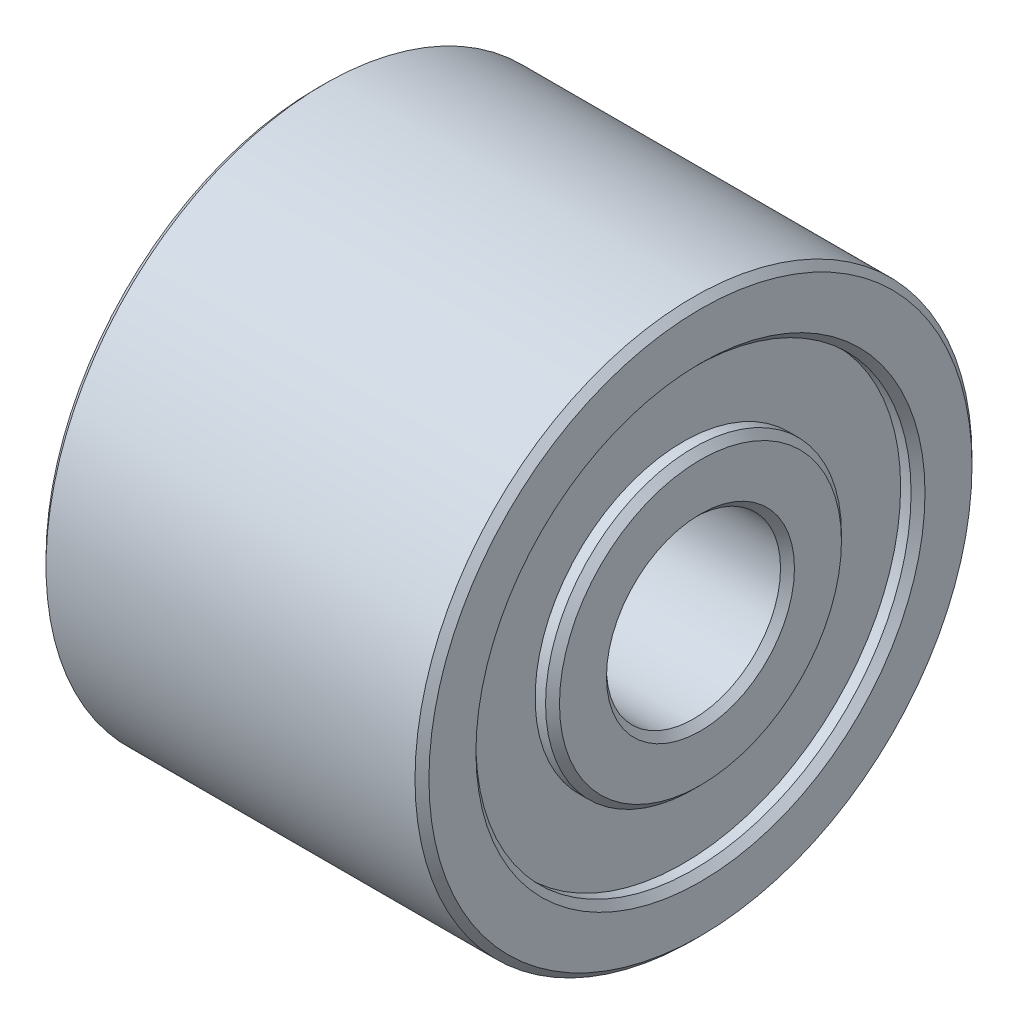
ISO-10303-21;
HEADER;
FILE_DESCRIPTION(('STEP AP214'),'2;1');
FILE_NAME('part.step','',(''),(''),'','','');
FILE_SCHEMA(('AUTOMOTIVE_DESIGN { 1 0 10303 214 1 1 1 1 }'));
ENDSEC;
DATA;
#1=APPLICATION_CONTEXT('core data for automotive mechanical design processes');
#2=APPLICATION_PROTOCOL_DEFINITION('international standard','automotive_design',2000,#1);
#3=PRODUCT_CONTEXT('',#1,'mechanical');
#4=PRODUCT('Part','Part','',(#3));
#5=PRODUCT_RELATED_PRODUCT_CATEGORY('part','',(#4));
#6=PRODUCT_DEFINITION_FORMATION('','',#4);
#7=PRODUCT_DEFINITION_CONTEXT('part definition',#1,'design');
#8=PRODUCT_DEFINITION('design','',#6,#7);
#9=PRODUCT_DEFINITION_SHAPE('','',#8);
#10=(LENGTH_UNIT() NAMED_UNIT(*) SI_UNIT(.MILLI.,.METRE.));
#11=(NAMED_UNIT(*) PLANE_ANGLE_UNIT() SI_UNIT($,.RADIAN.));
#12=(NAMED_UNIT(*) SI_UNIT($,.STERADIAN.) SOLID_ANGLE_UNIT());
#13=UNCERTAINTY_MEASURE_WITH_UNIT(LENGTH_MEASURE(1.E-05),#10,'distance_accuracy_value','');
#14=(GEOMETRIC_REPRESENTATION_CONTEXT(3) GLOBAL_UNCERTAINTY_ASSIGNED_CONTEXT((#13)) GLOBAL_UNIT_ASSIGNED_CONTEXT((#10,
#11,#12)) REPRESENTATION_CONTEXT('',''));
#15=CARTESIAN_POINT('',(0.,0.,0.));
#16=DIRECTION('',(0.,0.,1.));
#17=DIRECTION('',(1.,0.,0.));
#18=AXIS2_PLACEMENT_3D('',#15,#16,#17);
#19=CARTESIAN_POINT('',(0.,0.,0.));
#20=DIRECTION('',(1.,0.,0.));
#21=DIRECTION('',(0.,0.,-1.));
#22=AXIS2_PLACEMENT_3D('',#19,#20,#21);
#23=CYLINDRICAL_SURFACE('',#22,2.5);
#24=CARTESIAN_POINT('',(5.30000000003383,0.,0.));
#25=DIRECTION('',(1.,0.,0.));
#26=DIRECTION('',(0.,0.,-1.));
#27=AXIS2_PLACEMENT_3D('',#24,#25,#26);
#28=CIRCLE('',#27,2.49999999999773);
#29=CARTESIAN_POINT('',(5.30000000003383,0.,-2.49999999999773));
#30=VERTEX_POINT('',#29);
#31=EDGE_CURVE('E53',#30,#30,#28,.T.);
#32=ORIENTED_EDGE('',*,*,#31,.T.);
#33=EDGE_LOOP('',(#32));
#34=FACE_BOUND('',#33,.T.);
#35=CARTESIAN_POINT('',(-5.29999999997699,0.,0.));
#36=DIRECTION('',(-1.,0.,0.));
#37=DIRECTION('',(0.,0.,1.));
#38=AXIS2_PLACEMENT_3D('',#35,#36,#37);
#39=CIRCLE('',#38,2.49999999994088);
#40=CARTESIAN_POINT('',(-5.29999999997699,0.,2.49999999994088));
#41=VERTEX_POINT('',#40);
#42=EDGE_CURVE('E50',#41,#41,#39,.T.);
#43=ORIENTED_EDGE('',*,*,#42,.T.);
#44=EDGE_LOOP('',(#43));
#45=FACE_BOUND('',#44,.T.);
#46=ADVANCED_FACE('F15',(#34,#45),#23,.F.);
#47=CARTESIAN_POINT('',(5.49999999998363,0.,0.));
#48=DIRECTION('',(1.,0.,0.));
#49=DIRECTION('',(0.,0.,-1.));
#50=AXIS2_PLACEMENT_3D('',#47,#48,#49);
#51=CONICAL_SURFACE('',#50,2.69999999994752,0.785398163397448);
#52=CARTESIAN_POINT('',(5.49999999998363,0.,0.));
#53=DIRECTION('',(1.,0.,0.));
#54=DIRECTION('',(0.,0.,-1.));
#55=AXIS2_PLACEMENT_3D('',#52,#53,#54);
#56=CIRCLE('',#55,2.69999999994752);
#57=CARTESIAN_POINT('',(5.49999999998363,0.,-2.69999999994752));
#58=VERTEX_POINT('',#57);
#59=EDGE_CURVE('E18',#58,#58,#56,.F.);
#60=ORIENTED_EDGE('',*,*,#59,.F.);
#61=EDGE_LOOP('',(#60));
#62=FACE_BOUND('',#61,.T.);
#63=ORIENTED_EDGE('',*,*,#31,.F.);
#64=EDGE_LOOP('',(#63));
#65=FACE_BOUND('',#64,.T.);
#66=ADVANCED_FACE('F90',(#62,#65),#51,.F.);
#67=CARTESIAN_POINT('',(-5.49999999998363,0.,0.));
#68=DIRECTION('',(-1.,0.,0.));
#69=DIRECTION('',(0.,0.,1.));
#70=AXIS2_PLACEMENT_3D('',#67,#68,#69);
#71=CONICAL_SURFACE('',#70,2.70000000000437,0.785398163539557);
#72=CARTESIAN_POINT('',(-5.49999999998363,0.,0.));
#73=DIRECTION('',(-1.,0.,0.));
#74=DIRECTION('',(0.,0.,1.));
#75=AXIS2_PLACEMENT_3D('',#72,#73,#74);
#76=CIRCLE('',#75,2.70000000000437);
#77=CARTESIAN_POINT('',(-5.49999999998363,0.,2.70000000000437));
#78=VERTEX_POINT('',#77);
#79=EDGE_CURVE('E80',#78,#78,#76,.F.);
#80=ORIENTED_EDGE('',*,*,#79,.F.);
#81=EDGE_LOOP('',(#80));
#82=FACE_BOUND('',#81,.T.);
#83=ORIENTED_EDGE('',*,*,#42,.F.);
#84=EDGE_LOOP('',(#83));
#85=FACE_BOUND('',#84,.T.);
#86=ADVANCED_FACE('F93',(#82,#85),#71,.F.);
#87=CARTESIAN_POINT('',(5.5,2.5,0.));
#88=DIRECTION('',(1.,0.,0.));
#89=DIRECTION('',(0.,0.,-1.));
#90=AXIS2_PLACEMENT_3D('',#87,#88,#89);
#91=PLANE('',#90);
#92=ORIENTED_EDGE('',*,*,#59,.T.);
#93=EDGE_LOOP('',(#92));
#94=FACE_BOUND('',#93,.T.);
#95=CARTESIAN_POINT('',(5.49999999998363,0.,0.));
#96=DIRECTION('',(-1.,0.,0.));
#97=DIRECTION('',(0.,0.,1.));
#98=AXIS2_PLACEMENT_3D('',#95,#96,#97);
#99=CIRCLE('',#98,4.05000000000655);
#100=CARTESIAN_POINT('',(5.49999999998363,0.,4.05000000000655));
#101=VERTEX_POINT('',#100);
#102=EDGE_CURVE('E78',#101,#101,#99,.T.);
#103=ORIENTED_EDGE('',*,*,#102,.F.);
#104=EDGE_LOOP('',(#103));
#105=FACE_BOUND('',#104,.T.);
#106=ADVANCED_FACE('F87',(#94,#105),#91,.T.);
#107=CARTESIAN_POINT('',(-5.5,2.5,0.));
#108=DIRECTION('',(-1.,0.,0.));
#109=DIRECTION('',(0.,0.,1.));
#110=AXIS2_PLACEMENT_3D('',#107,#108,#109);
#111=PLANE('',#110);
#112=ORIENTED_EDGE('',*,*,#79,.T.);
#113=EDGE_LOOP('',(#112));
#114=FACE_BOUND('',#113,.T.);
#115=CARTESIAN_POINT('',(-5.50000000004047,0.,0.));
#116=DIRECTION('',(1.,0.,0.));
#117=DIRECTION('',(0.,0.,-1.));
#118=AXIS2_PLACEMENT_3D('',#115,#116,#117);
#119=CIRCLE('',#118,4.05000000000655);
#120=CARTESIAN_POINT('',(-5.50000000004047,0.,-4.05000000000655));
#121=VERTEX_POINT('',#120);
#122=EDGE_CURVE('E47',#121,#121,#119,.T.);
#123=ORIENTED_EDGE('',*,*,#122,.F.);
#124=EDGE_LOOP('',(#123));
#125=FACE_BOUND('',#124,.T.);
#126=ADVANCED_FACE('F107',(#114,#125),#111,.T.);
#127=CARTESIAN_POINT('',(5.29999999997699,0.,0.));
#128=DIRECTION('',(-1.,0.,0.));
#129=DIRECTION('',(0.,0.,1.));
#130=AXIS2_PLACEMENT_3D('',#127,#128,#129);
#131=CONICAL_SURFACE('',#130,4.25000000001319,0.785398163397448);
#132=ORIENTED_EDGE('',*,*,#102,.T.);
#133=EDGE_LOOP('',(#132));
#134=FACE_BOUND('',#133,.T.);
#135=CARTESIAN_POINT('',(5.3,0.,0.));
#136=DIRECTION('',(1.,0.,0.));
#137=DIRECTION('',(0.,0.,-1.));
#138=AXIS2_PLACEMENT_3D('',#135,#136,#137);
#139=CIRCLE('',#138,4.25);
#140=CARTESIAN_POINT('',(5.3,0.,-4.25));
#141=VERTEX_POINT('',#140);
#142=EDGE_CURVE('E44',#141,#141,#139,.F.);
#143=ORIENTED_EDGE('',*,*,#142,.F.);
#144=EDGE_LOOP('',(#143));
#145=FACE_BOUND('',#144,.T.);
#146=ADVANCED_FACE('F167',(#134,#145),#131,.T.);
#147=CARTESIAN_POINT('',(-5.29999999997699,0.,0.));
#148=DIRECTION('',(1.,0.,0.));
#149=DIRECTION('',(0.,0.,-1.));
#150=AXIS2_PLACEMENT_3D('',#147,#148,#149);
#151=CONICAL_SURFACE('',#150,4.25000000007003,0.785398163397448);
#152=ORIENTED_EDGE('',*,*,#122,.T.);
#153=EDGE_LOOP('',(#152));
#154=FACE_BOUND('',#153,.T.);
#155=CARTESIAN_POINT('',(-5.3,0.,0.));
#156=DIRECTION('',(1.,0.,0.));
#157=DIRECTION('',(0.,0.,-1.));
#158=AXIS2_PLACEMENT_3D('',#155,#156,#157);
#159=CIRCLE('',#158,4.25);
#160=CARTESIAN_POINT('',(-5.3,0.,-4.25));
#161=VERTEX_POINT('',#160);
#162=EDGE_CURVE('E40',#161,#161,#159,.T.);
#163=ORIENTED_EDGE('',*,*,#162,.F.);
#164=EDGE_LOOP('',(#163));
#165=FACE_BOUND('',#164,.T.);
#166=ADVANCED_FACE('F163',(#154,#165),#151,.T.);
#167=CARTESIAN_POINT('',(0.,0.,0.));
#168=DIRECTION('',(1.,0.,0.));
#169=DIRECTION('',(0.,0.,-1.));
#170=AXIS2_PLACEMENT_3D('',#167,#168,#169);
#171=CYLINDRICAL_SURFACE('',#170,4.25);
#172=CARTESIAN_POINT('',(5.,0.,0.));
#173=DIRECTION('',(1.,0.,0.));
#174=DIRECTION('',(0.,0.,-1.));
#175=AXIS2_PLACEMENT_3D('',#172,#173,#174);
#176=CIRCLE('',#175,4.25);
#177=CARTESIAN_POINT('',(5.,0.,-4.25));
#178=VERTEX_POINT('',#177);
#179=EDGE_CURVE('E43',#178,#178,#176,.F.);
#180=ORIENTED_EDGE('',*,*,#179,.F.);
#181=EDGE_LOOP('',(#180));
#182=FACE_BOUND('',#181,.T.);
#183=ORIENTED_EDGE('',*,*,#142,.T.);
#184=EDGE_LOOP('',(#183));
#185=FACE_BOUND('',#184,.T.);
#186=ADVANCED_FACE('F159',(#182,#185),#171,.T.);
#187=CARTESIAN_POINT('',(0.,0.,0.));
#188=DIRECTION('',(1.,0.,0.));
#189=DIRECTION('',(0.,0.,-1.));
#190=AXIS2_PLACEMENT_3D('',#187,#188,#189);
#191=CYLINDRICAL_SURFACE('',#190,4.25);
#192=ORIENTED_EDGE('',*,*,#162,.T.);
#193=EDGE_LOOP('',(#192));
#194=FACE_BOUND('',#193,.T.);
#195=CARTESIAN_POINT('',(-5.,0.,0.));
#196=DIRECTION('',(1.,0.,0.));
#197=DIRECTION('',(0.,0.,-1.));
#198=AXIS2_PLACEMENT_3D('',#195,#196,#197);
#199=CIRCLE('',#198,4.25);
#200=CARTESIAN_POINT('',(-5.,0.,-4.25));
#201=VERTEX_POINT('',#200);
#202=EDGE_CURVE('E71',#201,#201,#199,.T.);
#203=ORIENTED_EDGE('',*,*,#202,.F.);
#204=EDGE_LOOP('',(#203));
#205=FACE_BOUND('',#204,.T.);
#206=ADVANCED_FACE('F155',(#194,#205),#191,.T.);
#207=CARTESIAN_POINT('',(5.,4.25,0.));
#208=DIRECTION('',(1.,0.,0.));
#209=DIRECTION('',(0.,0.,-1.));
#210=AXIS2_PLACEMENT_3D('',#207,#208,#209);
#211=PLANE('',#210);
#212=ORIENTED_EDGE('',*,*,#179,.T.);
#213=EDGE_LOOP('',(#212));
#214=FACE_BOUND('',#213,.T.);
#215=CARTESIAN_POINT('',(5.,0.,0.));
#216=DIRECTION('',(1.,0.,0.));
#217=DIRECTION('',(0.,0.,-1.));
#218=AXIS2_PLACEMENT_3D('',#215,#216,#217);
#219=CIRCLE('',#218,6.25);
#220=CARTESIAN_POINT('',(5.,0.,-6.25));
#221=VERTEX_POINT('',#220);
#222=EDGE_CURVE('E68',#221,#221,#219,.T.);
#223=ORIENTED_EDGE('',*,*,#222,.T.);
#224=EDGE_LOOP('',(#223));
#225=FACE_BOUND('',#224,.T.);
#226=ADVANCED_FACE('F151',(#214,#225),#211,.T.);
#227=CARTESIAN_POINT('',(-5.,4.25,0.));
#228=DIRECTION('',(-1.,0.,0.));
#229=DIRECTION('',(0.,0.,1.));
#230=AXIS2_PLACEMENT_3D('',#227,#228,#229);
#231=PLANE('',#230);
#232=ORIENTED_EDGE('',*,*,#202,.T.);
#233=EDGE_LOOP('',(#232));
#234=FACE_BOUND('',#233,.T.);
#235=CARTESIAN_POINT('',(-5.,0.,0.));
#236=DIRECTION('',(1.,0.,0.));
#237=DIRECTION('',(0.,0.,-1.));
#238=AXIS2_PLACEMENT_3D('',#235,#236,#237);
#239=CIRCLE('',#238,6.25);
#240=CARTESIAN_POINT('',(-5.,0.,-6.25));
#241=VERTEX_POINT('',#240);
#242=EDGE_CURVE('E39',#241,#241,#239,.F.);
#243=ORIENTED_EDGE('',*,*,#242,.T.);
#244=EDGE_LOOP('',(#243));
#245=FACE_BOUND('',#244,.T.);
#246=ADVANCED_FACE('F147',(#234,#245),#231,.T.);
#247=CARTESIAN_POINT('',(0.,0.,0.));
#248=DIRECTION('',(1.,0.,0.));
#249=DIRECTION('',(0.,0.,-1.));
#250=AXIS2_PLACEMENT_3D('',#247,#248,#249);
#251=CYLINDRICAL_SURFACE('',#250,6.25);
#252=CARTESIAN_POINT('',(5.29999999992015,0.,0.));
#253=DIRECTION('',(1.,0.,0.));
#254=DIRECTION('',(0.,0.,-1.));
#255=AXIS2_PLACEMENT_3D('',#252,#253,#254);
#256=CIRCLE('',#255,6.25000000002274);
#257=CARTESIAN_POINT('',(5.29999999992015,0.,-6.25000000002274));
#258=VERTEX_POINT('',#257);
#259=EDGE_CURVE('E36',#258,#258,#256,.T.);
#260=ORIENTED_EDGE('',*,*,#259,.T.);
#261=EDGE_LOOP('',(#260));
#262=FACE_BOUND('',#261,.T.);
#263=ORIENTED_EDGE('',*,*,#222,.F.);
#264=EDGE_LOOP('',(#263));
#265=FACE_BOUND('',#264,.T.);
#266=ADVANCED_FACE('F143',(#262,#265),#251,.F.);
#267=CARTESIAN_POINT('',(0.,0.,0.));
#268=DIRECTION('',(1.,0.,0.));
#269=DIRECTION('',(0.,0.,-1.));
#270=AXIS2_PLACEMENT_3D('',#267,#268,#269);
#271=CYLINDRICAL_SURFACE('',#270,6.25);
#272=ORIENTED_EDGE('',*,*,#242,.F.);
#273=EDGE_LOOP('',(#272));
#274=FACE_BOUND('',#273,.T.);
#275=CARTESIAN_POINT('',(-5.30000000003383,0.,0.));
#276=DIRECTION('',(-1.,0.,0.));
#277=DIRECTION('',(0.,0.,1.));
#278=AXIS2_PLACEMENT_3D('',#275,#276,#277);
#279=CIRCLE('',#278,6.25000000002274);
#280=CARTESIAN_POINT('',(-5.30000000003383,0.,6.25000000002274));
#281=VERTEX_POINT('',#280);
#282=EDGE_CURVE('E32',#281,#281,#279,.T.);
#283=ORIENTED_EDGE('',*,*,#282,.T.);
#284=EDGE_LOOP('',(#283));
#285=FACE_BOUND('',#284,.T.);
#286=ADVANCED_FACE('F139',(#274,#285),#271,.F.);
#287=CARTESIAN_POINT('',(5.49999999998363,0.,0.));
#288=DIRECTION('',(1.,0.,0.));
#289=DIRECTION('',(0.,0.,-1.));
#290=AXIS2_PLACEMENT_3D('',#287,#288,#289);
#291=CONICAL_SURFACE('',#290,6.45000000008622,0.785398163397448);
#292=CARTESIAN_POINT('',(5.49999999998363,0.,0.));
#293=DIRECTION('',(1.,0.,0.));
#294=DIRECTION('',(0.,0.,-1.));
#295=AXIS2_PLACEMENT_3D('',#292,#293,#294);
#296=CIRCLE('',#295,6.45000000008622);
#297=CARTESIAN_POINT('',(5.49999999998363,0.,-6.45000000008622));
#298=VERTEX_POINT('',#297);
#299=EDGE_CURVE('E35',#298,#298,#296,.F.);
#300=ORIENTED_EDGE('',*,*,#299,.F.);
#301=EDGE_LOOP('',(#300));
#302=FACE_BOUND('',#301,.T.);
#303=ORIENTED_EDGE('',*,*,#259,.F.);
#304=EDGE_LOOP('',(#303));
#305=FACE_BOUND('',#304,.T.);
#306=ADVANCED_FACE('F135',(#302,#305),#291,.F.);
#307=CARTESIAN_POINT('',(-5.49999999992679,0.,0.));
#308=DIRECTION('',(-1.,0.,0.));
#309=DIRECTION('',(0.,0.,1.));
#310=AXIS2_PLACEMENT_3D('',#307,#308,#309);
#311=CONICAL_SURFACE('',#310,6.44999999985885,0.785398163397448);
#312=CARTESIAN_POINT('',(-5.50000000004047,0.,0.));
#313=DIRECTION('',(-1.,0.,0.));
#314=DIRECTION('',(0.,0.,1.));
#315=AXIS2_PLACEMENT_3D('',#312,#313,#314);
#316=CIRCLE('',#315,6.44999999997253);
#317=CARTESIAN_POINT('',(-5.50000000004047,0.,6.44999999997253));
#318=VERTEX_POINT('',#317);
#319=EDGE_CURVE('E61',#318,#318,#316,.F.);
#320=ORIENTED_EDGE('',*,*,#319,.F.);
#321=EDGE_LOOP('',(#320));
#322=FACE_BOUND('',#321,.T.);
#323=ORIENTED_EDGE('',*,*,#282,.F.);
#324=EDGE_LOOP('',(#323));
#325=FACE_BOUND('',#324,.T.);
#326=ADVANCED_FACE('F131',(#322,#325),#311,.F.);
#327=CARTESIAN_POINT('',(5.5,6.25,0.));
#328=DIRECTION('',(1.,0.,0.));
#329=DIRECTION('',(0.,0.,-1.));
#330=AXIS2_PLACEMENT_3D('',#327,#328,#329);
#331=PLANE('',#330);
#332=ORIENTED_EDGE('',*,*,#299,.T.);
#333=EDGE_LOOP('',(#332));
#334=FACE_BOUND('',#333,.T.);
#335=CARTESIAN_POINT('',(5.5,0.,0.));
#336=DIRECTION('',(-1.,0.,0.));
#337=DIRECTION('',(0.,0.,1.));
#338=AXIS2_PLACEMENT_3D('',#335,#336,#337);
#339=CIRCLE('',#338,7.8);
#340=CARTESIAN_POINT('',(5.5,0.,7.8));
#341=VERTEX_POINT('',#340);
#342=EDGE_CURVE('E58',#341,#341,#339,.T.);
#343=ORIENTED_EDGE('',*,*,#342,.F.);
#344=EDGE_LOOP('',(#343));
#345=FACE_BOUND('',#344,.T.);
#346=ADVANCED_FACE('F127',(#334,#345),#331,.T.);
#347=CARTESIAN_POINT('',(-5.5,6.25,0.));
#348=DIRECTION('',(-1.,0.,0.));
#349=DIRECTION('',(0.,0.,1.));
#350=AXIS2_PLACEMENT_3D('',#347,#348,#349);
#351=PLANE('',#350);
#352=ORIENTED_EDGE('',*,*,#319,.T.);
#353=EDGE_LOOP('',(#352));
#354=FACE_BOUND('',#353,.T.);
#355=CARTESIAN_POINT('',(-5.5,0.,0.));
#356=DIRECTION('',(1.,0.,0.));
#357=DIRECTION('',(0.,0.,-1.));
#358=AXIS2_PLACEMENT_3D('',#355,#356,#357);
#359=CIRCLE('',#358,7.8);
#360=CARTESIAN_POINT('',(-5.5,0.,-7.8));
#361=VERTEX_POINT('',#360);
#362=EDGE_CURVE('E27',#361,#361,#359,.T.);
#363=ORIENTED_EDGE('',*,*,#362,.F.);
#364=EDGE_LOOP('',(#363));
#365=FACE_BOUND('',#364,.T.);
#366=ADVANCED_FACE('F123',(#354,#365),#351,.T.);
#367=CARTESIAN_POINT('',(5.3,0.,0.));
#368=DIRECTION('',(-1.,0.,0.));
#369=DIRECTION('',(0.,0.,1.));
#370=AXIS2_PLACEMENT_3D('',#367,#368,#369);
#371=CONICAL_SURFACE('',#370,8.,0.785398163397457);
#372=ORIENTED_EDGE('',*,*,#342,.T.);
#373=EDGE_LOOP('',(#372));
#374=FACE_BOUND('',#373,.T.);
#375=CARTESIAN_POINT('',(5.3,0.,0.));
#376=DIRECTION('',(1.,0.,0.));
#377=DIRECTION('',(0.,0.,-1.));
#378=AXIS2_PLACEMENT_3D('',#375,#376,#377);
#379=CIRCLE('',#378,8.);
#380=CARTESIAN_POINT('',(5.3,0.,-8.));
#381=VERTEX_POINT('',#380);
#382=EDGE_CURVE('E22',#381,#381,#379,.F.);
#383=ORIENTED_EDGE('',*,*,#382,.F.);
#384=EDGE_LOOP('',(#383));
#385=FACE_BOUND('',#384,.T.);
#386=ADVANCED_FACE('F116',(#374,#385),#371,.T.);
#387=CARTESIAN_POINT('',(-5.3,0.,0.));
#388=DIRECTION('',(1.,0.,0.));
#389=DIRECTION('',(0.,0.,-1.));
#390=AXIS2_PLACEMENT_3D('',#387,#388,#389);
#391=CONICAL_SURFACE('',#390,8.,0.785398163397459);
#392=ORIENTED_EDGE('',*,*,#362,.T.);
#393=EDGE_LOOP('',(#392));
#394=FACE_BOUND('',#393,.T.);
#395=CARTESIAN_POINT('',(-5.3,0.,0.));
#396=DIRECTION('',(1.,0.,0.));
#397=DIRECTION('',(0.,0.,-1.));
#398=AXIS2_PLACEMENT_3D('',#395,#396,#397);
#399=CIRCLE('',#398,8.);
#400=CARTESIAN_POINT('',(-5.3,0.,-8.));
#401=VERTEX_POINT('',#400);
#402=EDGE_CURVE('E10',#401,#401,#399,.T.);
#403=ORIENTED_EDGE('',*,*,#402,.F.);
#404=EDGE_LOOP('',(#403));
#405=FACE_BOUND('',#404,.T.);
#406=ADVANCED_FACE('F111',(#394,#405),#391,.T.);
#407=CARTESIAN_POINT('',(0.,0.,0.));
#408=DIRECTION('',(1.,0.,0.));
#409=DIRECTION('',(0.,0.,-1.));
#410=AXIS2_PLACEMENT_3D('',#407,#408,#409);
#411=CYLINDRICAL_SURFACE('',#410,8.);
#412=ORIENTED_EDGE('',*,*,#402,.T.);
#413=EDGE_LOOP('',(#412));
#414=FACE_BOUND('',#413,.T.);
#415=ORIENTED_EDGE('',*,*,#382,.T.);
#416=EDGE_LOOP('',(#415));
#417=FACE_BOUND('',#416,.T.);
#418=ADVANCED_FACE('F109',(#414,#417),#411,.T.);
#419=CLOSED_SHELL('',(#46,#66,#86,#106,#126,#146,#166,#186,#206,#226,#246,#266,#286,#306,#326,
#346,#366,#386,#406,#418));
#420=MANIFOLD_SOLID_BREP('B1',#419);
#421=ADVANCED_BREP_SHAPE_REPRESENTATION('',(#18,#420),#14);
#422=SHAPE_DEFINITION_REPRESENTATION(#9,#421);
ENDSEC;
END-ISO-10303-21;
